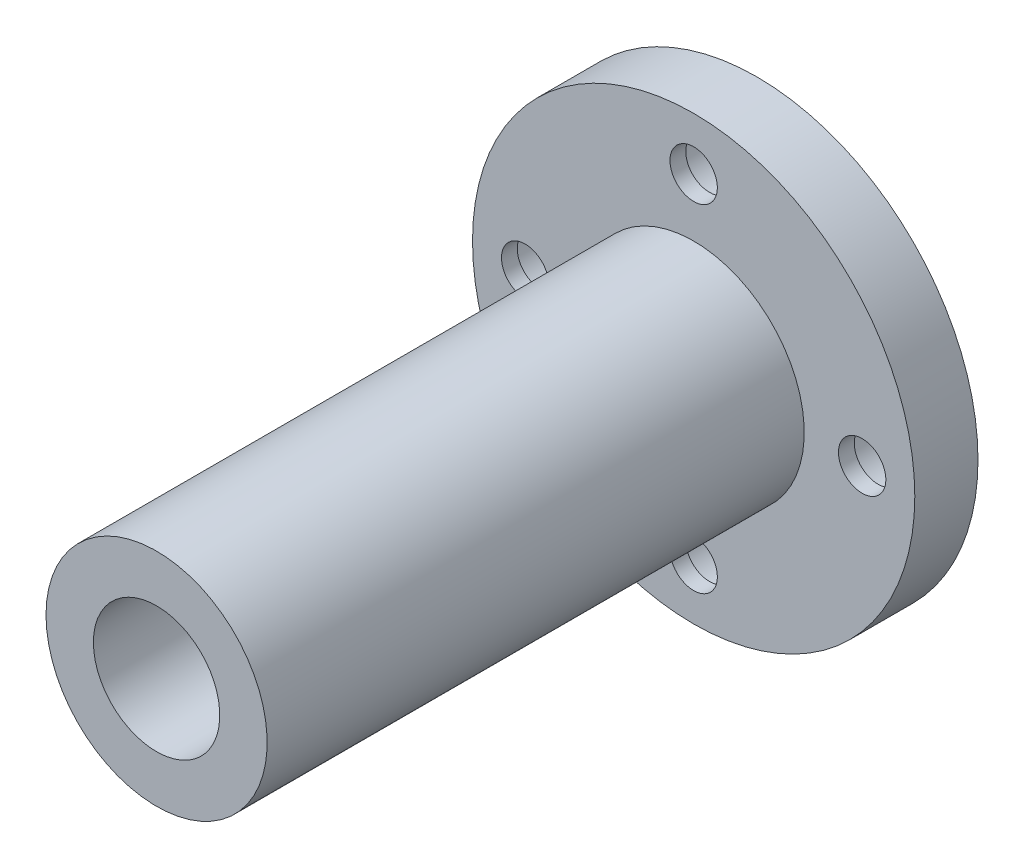
ISO-10303-21;
HEADER;
FILE_DESCRIPTION(('STEP AP214'),'2;1');
FILE_NAME('part.step','',(''),(''),'','','');
FILE_SCHEMA(('AUTOMOTIVE_DESIGN { 1 0 10303 214 1 1 1 1 }'));
ENDSEC;
DATA;
#1=APPLICATION_CONTEXT('core data for automotive mechanical design processes');
#2=APPLICATION_PROTOCOL_DEFINITION('international standard','automotive_design',2000,#1);
#3=PRODUCT_CONTEXT('',#1,'mechanical');
#4=PRODUCT('Part','Part','',(#3));
#5=PRODUCT_RELATED_PRODUCT_CATEGORY('part','',(#4));
#6=PRODUCT_DEFINITION_FORMATION('','',#4);
#7=PRODUCT_DEFINITION_CONTEXT('part definition',#1,'design');
#8=PRODUCT_DEFINITION('design','',#6,#7);
#9=PRODUCT_DEFINITION_SHAPE('','',#8);
#10=(LENGTH_UNIT() NAMED_UNIT(*) SI_UNIT(.MILLI.,.METRE.));
#11=(NAMED_UNIT(*) PLANE_ANGLE_UNIT() SI_UNIT($,.RADIAN.));
#12=(NAMED_UNIT(*) SI_UNIT($,.STERADIAN.) SOLID_ANGLE_UNIT());
#13=UNCERTAINTY_MEASURE_WITH_UNIT(LENGTH_MEASURE(1.E-05),#10,'distance_accuracy_value','');
#14=(GEOMETRIC_REPRESENTATION_CONTEXT(3) GLOBAL_UNCERTAINTY_ASSIGNED_CONTEXT((#13)) GLOBAL_UNIT_ASSIGNED_CONTEXT((#10,
#11,#12)) REPRESENTATION_CONTEXT('',''));
#15=CARTESIAN_POINT('',(0.,0.,0.));
#16=DIRECTION('',(0.,0.,1.));
#17=DIRECTION('',(1.,0.,0.));
#18=AXIS2_PLACEMENT_3D('',#15,#16,#17);
#19=CARTESIAN_POINT('',(16.,0.,0.));
#20=DIRECTION('',(0.,0.,1.));
#21=DIRECTION('',(1.,0.,0.));
#22=AXIS2_PLACEMENT_3D('',#19,#20,#21);
#23=CYLINDRICAL_SURFACE('',#22,2.25);
#24=CARTESIAN_POINT('',(16.,0.,6.));
#25=DIRECTION('',(0.,0.,1.));
#26=DIRECTION('',(1.,0.,0.));
#27=AXIS2_PLACEMENT_3D('',#24,#25,#26);
#28=CIRCLE('',#27,2.25);
#29=CARTESIAN_POINT('',(18.25,0.,6.));
#30=VERTEX_POINT('',#29);
#31=EDGE_CURVE('E86',#30,#30,#28,.T.);
#32=ORIENTED_EDGE('',*,*,#31,.T.);
#33=EDGE_LOOP('',(#32));
#34=FACE_BOUND('',#33,.T.);
#35=CARTESIAN_POINT('',(16.,0.,4.5));
#36=DIRECTION('',(0.,0.,-1.));
#37=DIRECTION('',(-1.,0.,0.));
#38=AXIS2_PLACEMENT_3D('',#35,#36,#37);
#39=CIRCLE('',#38,2.25);
#40=CARTESIAN_POINT('',(13.75,0.,4.5));
#41=VERTEX_POINT('',#40);
#42=EDGE_CURVE('E34',#41,#41,#39,.F.);
#43=ORIENTED_EDGE('',*,*,#42,.F.);
#44=EDGE_LOOP('',(#43));
#45=FACE_BOUND('',#44,.T.);
#46=ADVANCED_FACE('F30',(#34,#45),#23,.F.);
#47=CARTESIAN_POINT('',(0.,-16.,0.));
#48=DIRECTION('',(0.,0.,1.));
#49=DIRECTION('',(1.,0.,0.));
#50=AXIS2_PLACEMENT_3D('',#47,#48,#49);
#51=CYLINDRICAL_SURFACE('',#50,2.25);
#52=CARTESIAN_POINT('',(0.,-16.,6.));
#53=DIRECTION('',(0.,0.,1.));
#54=DIRECTION('',(1.,0.,0.));
#55=AXIS2_PLACEMENT_3D('',#52,#53,#54);
#56=CIRCLE('',#55,2.25);
#57=CARTESIAN_POINT('',(2.25,-16.,6.));
#58=VERTEX_POINT('',#57);
#59=EDGE_CURVE('E83',#58,#58,#56,.T.);
#60=ORIENTED_EDGE('',*,*,#59,.T.);
#61=EDGE_LOOP('',(#60));
#62=FACE_BOUND('',#61,.T.);
#63=CARTESIAN_POINT('',(0.,-16.,4.5));
#64=DIRECTION('',(0.,0.,-1.));
#65=DIRECTION('',(-1.,0.,0.));
#66=AXIS2_PLACEMENT_3D('',#63,#64,#65);
#67=CIRCLE('',#66,2.25);
#68=CARTESIAN_POINT('',(-2.25,-16.,4.5));
#69=VERTEX_POINT('',#68);
#70=EDGE_CURVE('E56',#69,#69,#67,.F.);
#71=ORIENTED_EDGE('',*,*,#70,.F.);
#72=EDGE_LOOP('',(#71));
#73=FACE_BOUND('',#72,.T.);
#74=ADVANCED_FACE('F118',(#62,#73),#51,.F.);
#75=CARTESIAN_POINT('',(-16.,0.,0.));
#76=DIRECTION('',(0.,0.,1.));
#77=DIRECTION('',(1.,0.,0.));
#78=AXIS2_PLACEMENT_3D('',#75,#76,#77);
#79=CYLINDRICAL_SURFACE('',#78,2.25);
#80=CARTESIAN_POINT('',(-16.,0.,6.));
#81=DIRECTION('',(0.,0.,1.));
#82=DIRECTION('',(1.,0.,0.));
#83=AXIS2_PLACEMENT_3D('',#80,#81,#82);
#84=CIRCLE('',#83,2.25);
#85=CARTESIAN_POINT('',(-13.75,0.,6.));
#86=VERTEX_POINT('',#85);
#87=EDGE_CURVE('E50',#86,#86,#84,.T.);
#88=ORIENTED_EDGE('',*,*,#87,.T.);
#89=EDGE_LOOP('',(#88));
#90=FACE_BOUND('',#89,.T.);
#91=CARTESIAN_POINT('',(-16.,0.,4.5));
#92=DIRECTION('',(0.,0.,-1.));
#93=DIRECTION('',(-1.,0.,0.));
#94=AXIS2_PLACEMENT_3D('',#91,#92,#93);
#95=CIRCLE('',#94,2.25);
#96=CARTESIAN_POINT('',(-18.25,0.,4.5));
#97=VERTEX_POINT('',#96);
#98=EDGE_CURVE('E52',#97,#97,#95,.F.);
#99=ORIENTED_EDGE('',*,*,#98,.F.);
#100=EDGE_LOOP('',(#99));
#101=FACE_BOUND('',#100,.T.);
#102=ADVANCED_FACE('F124',(#90,#101),#79,.F.);
#103=CARTESIAN_POINT('',(0.,16.,0.));
#104=DIRECTION('',(0.,0.,1.));
#105=DIRECTION('',(1.,0.,0.));
#106=AXIS2_PLACEMENT_3D('',#103,#104,#105);
#107=CYLINDRICAL_SURFACE('',#106,2.25);
#108=CARTESIAN_POINT('',(0.,16.,6.));
#109=DIRECTION('',(0.,0.,1.));
#110=DIRECTION('',(1.,0.,0.));
#111=AXIS2_PLACEMENT_3D('',#108,#109,#110);
#112=CIRCLE('',#111,2.25);
#113=CARTESIAN_POINT('',(2.25,16.,6.));
#114=VERTEX_POINT('',#113);
#115=EDGE_CURVE('E89',#114,#114,#112,.T.);
#116=ORIENTED_EDGE('',*,*,#115,.T.);
#117=EDGE_LOOP('',(#116));
#118=FACE_BOUND('',#117,.T.);
#119=CARTESIAN_POINT('',(0.,16.,4.5));
#120=DIRECTION('',(0.,0.,-1.));
#121=DIRECTION('',(-1.,0.,0.));
#122=AXIS2_PLACEMENT_3D('',#119,#120,#121);
#123=CIRCLE('',#122,2.25);
#124=CARTESIAN_POINT('',(-2.25,16.,4.5));
#125=VERTEX_POINT('',#124);
#126=EDGE_CURVE('E47',#125,#125,#123,.F.);
#127=ORIENTED_EDGE('',*,*,#126,.F.);
#128=EDGE_LOOP('',(#127));
#129=FACE_BOUND('',#128,.T.);
#130=ADVANCED_FACE('F130',(#118,#129),#107,.F.);
#131=CARTESIAN_POINT('',(0.,21.,0.));
#132=DIRECTION('',(0.,0.,-1.));
#133=DIRECTION('',(-1.,0.,0.));
#134=AXIS2_PLACEMENT_3D('',#131,#132,#133);
#135=PLANE('',#134);
#136=CARTESIAN_POINT('',(16.,0.,0.));
#137=DIRECTION('',(0.,0.,-1.));
#138=DIRECTION('',(-1.,0.,0.));
#139=AXIS2_PLACEMENT_3D('',#136,#137,#138);
#140=CIRCLE('',#139,3.75);
#141=CARTESIAN_POINT('',(12.25,0.,0.));
#142=VERTEX_POINT('',#141);
#143=EDGE_CURVE('E72',#142,#142,#140,.T.);
#144=ORIENTED_EDGE('',*,*,#143,.F.);
#145=EDGE_LOOP('',(#144));
#146=FACE_BOUND('',#145,.T.);
#147=CARTESIAN_POINT('',(0.,-16.,0.));
#148=DIRECTION('',(0.,0.,-1.));
#149=DIRECTION('',(-1.,0.,0.));
#150=AXIS2_PLACEMENT_3D('',#147,#148,#149);
#151=CIRCLE('',#150,3.75);
#152=CARTESIAN_POINT('',(-3.75,-16.,0.));
#153=VERTEX_POINT('',#152);
#154=EDGE_CURVE('E65',#153,#153,#151,.T.);
#155=ORIENTED_EDGE('',*,*,#154,.F.);
#156=EDGE_LOOP('',(#155));
#157=FACE_BOUND('',#156,.T.);
#158=CARTESIAN_POINT('',(-16.,0.,0.));
#159=DIRECTION('',(0.,0.,-1.));
#160=DIRECTION('',(-1.,0.,0.));
#161=AXIS2_PLACEMENT_3D('',#158,#159,#160);
#162=CIRCLE('',#161,3.75);
#163=CARTESIAN_POINT('',(-19.75,0.,0.));
#164=VERTEX_POINT('',#163);
#165=EDGE_CURVE('E58',#164,#164,#162,.T.);
#166=ORIENTED_EDGE('',*,*,#165,.F.);
#167=EDGE_LOOP('',(#166));
#168=FACE_BOUND('',#167,.T.);
#169=CARTESIAN_POINT('',(0.,16.,0.));
#170=DIRECTION('',(0.,0.,-1.));
#171=DIRECTION('',(-1.,0.,0.));
#172=AXIS2_PLACEMENT_3D('',#169,#170,#171);
#173=CIRCLE('',#172,3.75);
#174=CARTESIAN_POINT('',(-3.75,16.,0.));
#175=VERTEX_POINT('',#174);
#176=EDGE_CURVE('E54',#175,#175,#173,.T.);
#177=ORIENTED_EDGE('',*,*,#176,.F.);
#178=EDGE_LOOP('',(#177));
#179=FACE_BOUND('',#178,.T.);
#180=CARTESIAN_POINT('',(0.,0.,0.));
#181=DIRECTION('',(0.,0.,-1.));
#182=DIRECTION('',(-1.,0.,0.));
#183=AXIS2_PLACEMENT_3D('',#180,#181,#182);
#184=CIRCLE('',#183,21.);
#185=CARTESIAN_POINT('',(-21.,0.,0.));
#186=VERTEX_POINT('',#185);
#187=EDGE_CURVE('E92',#186,#186,#184,.T.);
#188=ORIENTED_EDGE('',*,*,#187,.T.);
#189=EDGE_LOOP('',(#188));
#190=FACE_BOUND('',#189,.T.);
#191=CARTESIAN_POINT('',(0.,0.,0.));
#192=DIRECTION('',(0.,0.,-1.));
#193=DIRECTION('',(-1.,0.,0.));
#194=AXIS2_PLACEMENT_3D('',#191,#192,#193);
#195=CIRCLE('',#194,6.);
#196=CARTESIAN_POINT('',(-6.,0.,0.));
#197=VERTEX_POINT('',#196);
#198=EDGE_CURVE('E10',#197,#197,#195,.T.);
#199=ORIENTED_EDGE('',*,*,#198,.F.);
#200=EDGE_LOOP('',(#199));
#201=FACE_BOUND('',#200,.T.);
#202=ADVANCED_FACE('F32',(#146,#157,#168,#179,#190,#201),#135,.T.);
#203=CARTESIAN_POINT('',(0.,0.,0.));
#204=DIRECTION('',(0.,0.,-1.));
#205=DIRECTION('',(-1.,0.,0.));
#206=AXIS2_PLACEMENT_3D('',#203,#204,#205);
#207=CYLINDRICAL_SURFACE('',#206,6.);
#208=ORIENTED_EDGE('',*,*,#198,.T.);
#209=EDGE_LOOP('',(#208));
#210=FACE_BOUND('',#209,.T.);
#211=CARTESIAN_POINT('',(0.,0.,57.));
#212=DIRECTION('',(0.,0.,-1.));
#213=DIRECTION('',(-1.,0.,0.));
#214=AXIS2_PLACEMENT_3D('',#211,#212,#213);
#215=CIRCLE('',#214,5.99999999999999);
#216=CARTESIAN_POINT('',(-5.99999999999999,0.,57.));
#217=VERTEX_POINT('',#216);
#218=EDGE_CURVE('E38',#217,#217,#215,.T.);
#219=ORIENTED_EDGE('',*,*,#218,.F.);
#220=EDGE_LOOP('',(#219));
#221=FACE_BOUND('',#220,.T.);
#222=ADVANCED_FACE('F108',(#210,#221),#207,.F.);
#223=CARTESIAN_POINT('',(0.,5.99999999999999,57.));
#224=DIRECTION('',(0.,0.,1.));
#225=DIRECTION('',(1.,0.,0.));
#226=AXIS2_PLACEMENT_3D('',#223,#224,#225);
#227=PLANE('',#226);
#228=ORIENTED_EDGE('',*,*,#218,.T.);
#229=EDGE_LOOP('',(#228));
#230=FACE_BOUND('',#229,.T.);
#231=CARTESIAN_POINT('',(0.,0.,57.));
#232=DIRECTION('',(0.,0.,-1.));
#233=DIRECTION('',(-1.,0.,0.));
#234=AXIS2_PLACEMENT_3D('',#231,#232,#233);
#235=CIRCLE('',#234,10.5);
#236=CARTESIAN_POINT('',(-10.5,0.,57.));
#237=VERTEX_POINT('',#236);
#238=EDGE_CURVE('E43',#237,#237,#235,.T.);
#239=ORIENTED_EDGE('',*,*,#238,.F.);
#240=EDGE_LOOP('',(#239));
#241=FACE_BOUND('',#240,.T.);
#242=ADVANCED_FACE('F106',(#230,#241),#227,.T.);
#243=CARTESIAN_POINT('',(0.,0.,0.));
#244=DIRECTION('',(0.,0.,-1.));
#245=DIRECTION('',(-1.,0.,0.));
#246=AXIS2_PLACEMENT_3D('',#243,#244,#245);
#247=CYLINDRICAL_SURFACE('',#246,10.5);
#248=ORIENTED_EDGE('',*,*,#238,.T.);
#249=EDGE_LOOP('',(#248));
#250=FACE_BOUND('',#249,.T.);
#251=CARTESIAN_POINT('',(0.,0.,6.));
#252=DIRECTION('',(0.,0.,-1.));
#253=DIRECTION('',(-1.,0.,0.));
#254=AXIS2_PLACEMENT_3D('',#251,#252,#253);
#255=CIRCLE('',#254,10.5);
#256=CARTESIAN_POINT('',(-10.5,0.,6.));
#257=VERTEX_POINT('',#256);
#258=EDGE_CURVE('E98',#257,#257,#255,.T.);
#259=ORIENTED_EDGE('',*,*,#258,.F.);
#260=EDGE_LOOP('',(#259));
#261=FACE_BOUND('',#260,.T.);
#262=ADVANCED_FACE('F103',(#250,#261),#247,.T.);
#263=CARTESIAN_POINT('',(0.,10.5,6.));
#264=DIRECTION('',(0.,0.,1.));
#265=DIRECTION('',(1.,0.,0.));
#266=AXIS2_PLACEMENT_3D('',#263,#264,#265);
#267=PLANE('',#266);
#268=ORIENTED_EDGE('',*,*,#87,.F.);
#269=EDGE_LOOP('',(#268));
#270=FACE_BOUND('',#269,.T.);
#271=ORIENTED_EDGE('',*,*,#59,.F.);
#272=EDGE_LOOP('',(#271));
#273=FACE_BOUND('',#272,.T.);
#274=ORIENTED_EDGE('',*,*,#31,.F.);
#275=EDGE_LOOP('',(#274));
#276=FACE_BOUND('',#275,.T.);
#277=ORIENTED_EDGE('',*,*,#115,.F.);
#278=EDGE_LOOP('',(#277));
#279=FACE_BOUND('',#278,.T.);
#280=ORIENTED_EDGE('',*,*,#258,.T.);
#281=EDGE_LOOP('',(#280));
#282=FACE_BOUND('',#281,.T.);
#283=CARTESIAN_POINT('',(0.,0.,6.));
#284=DIRECTION('',(0.,0.,-1.));
#285=DIRECTION('',(-1.,0.,0.));
#286=AXIS2_PLACEMENT_3D('',#283,#284,#285);
#287=CIRCLE('',#286,21.);
#288=CARTESIAN_POINT('',(-21.,0.,6.));
#289=VERTEX_POINT('',#288);
#290=EDGE_CURVE('E95',#289,#289,#287,.T.);
#291=ORIENTED_EDGE('',*,*,#290,.F.);
#292=EDGE_LOOP('',(#291));
#293=FACE_BOUND('',#292,.T.);
#294=ADVANCED_FACE('F115',(#270,#273,#276,#279,#282,#293),#267,.T.);
#295=CARTESIAN_POINT('',(0.,0.,0.));
#296=DIRECTION('',(0.,0.,-1.));
#297=DIRECTION('',(-1.,0.,0.));
#298=AXIS2_PLACEMENT_3D('',#295,#296,#297);
#299=CYLINDRICAL_SURFACE('',#298,21.);
#300=ORIENTED_EDGE('',*,*,#290,.T.);
#301=EDGE_LOOP('',(#300));
#302=FACE_BOUND('',#301,.T.);
#303=ORIENTED_EDGE('',*,*,#187,.F.);
#304=EDGE_LOOP('',(#303));
#305=FACE_BOUND('',#304,.T.);
#306=ADVANCED_FACE('F134',(#302,#305),#299,.T.);
#307=CARTESIAN_POINT('',(0.,16.,4.5));
#308=DIRECTION('',(0.,0.,-1.));
#309=DIRECTION('',(-1.,0.,0.));
#310=AXIS2_PLACEMENT_3D('',#307,#308,#309);
#311=PLANE('',#310);
#312=CARTESIAN_POINT('',(0.,16.,4.5));
#313=DIRECTION('',(0.,0.,-1.));
#314=DIRECTION('',(-1.,0.,0.));
#315=AXIS2_PLACEMENT_3D('',#312,#313,#314);
#316=CIRCLE('',#315,3.75);
#317=CARTESIAN_POINT('',(-3.75,16.,4.5));
#318=VERTEX_POINT('',#317);
#319=EDGE_CURVE('E51',#318,#318,#316,.T.);
#320=ORIENTED_EDGE('',*,*,#319,.T.);
#321=EDGE_LOOP('',(#320));
#322=FACE_BOUND('',#321,.T.);
#323=ORIENTED_EDGE('',*,*,#126,.T.);
#324=EDGE_LOOP('',(#323));
#325=FACE_BOUND('',#324,.T.);
#326=ADVANCED_FACE('F137',(#322,#325),#311,.T.);
#327=CARTESIAN_POINT('',(0.,16.,4.5));
#328=DIRECTION('',(0.,0.,-1.));
#329=DIRECTION('',(-1.,0.,0.));
#330=AXIS2_PLACEMENT_3D('',#327,#328,#329);
#331=CYLINDRICAL_SURFACE('',#330,3.75);
#332=ORIENTED_EDGE('',*,*,#319,.F.);
#333=EDGE_LOOP('',(#332));
#334=FACE_BOUND('',#333,.T.);
#335=ORIENTED_EDGE('',*,*,#176,.T.);
#336=EDGE_LOOP('',(#335));
#337=FACE_BOUND('',#336,.T.);
#338=ADVANCED_FACE('F171',(#334,#337),#331,.F.);
#339=CARTESIAN_POINT('',(-16.,0.,4.5));
#340=DIRECTION('',(0.,0.,-1.));
#341=DIRECTION('',(-1.,0.,0.));
#342=AXIS2_PLACEMENT_3D('',#339,#340,#341);
#343=PLANE('',#342);
#344=CARTESIAN_POINT('',(-16.,0.,4.5));
#345=DIRECTION('',(0.,0.,-1.));
#346=DIRECTION('',(-1.,0.,0.));
#347=AXIS2_PLACEMENT_3D('',#344,#345,#346);
#348=CIRCLE('',#347,3.75);
#349=CARTESIAN_POINT('',(-19.75,0.,4.5));
#350=VERTEX_POINT('',#349);
#351=EDGE_CURVE('E55',#350,#350,#348,.T.);
#352=ORIENTED_EDGE('',*,*,#351,.T.);
#353=EDGE_LOOP('',(#352));
#354=FACE_BOUND('',#353,.T.);
#355=ORIENTED_EDGE('',*,*,#98,.T.);
#356=EDGE_LOOP('',(#355));
#357=FACE_BOUND('',#356,.T.);
#358=ADVANCED_FACE('F173',(#354,#357),#343,.T.);
#359=CARTESIAN_POINT('',(-16.,0.,4.5));
#360=DIRECTION('',(0.,0.,-1.));
#361=DIRECTION('',(-1.,0.,0.));
#362=AXIS2_PLACEMENT_3D('',#359,#360,#361);
#363=CYLINDRICAL_SURFACE('',#362,3.75);
#364=ORIENTED_EDGE('',*,*,#351,.F.);
#365=EDGE_LOOP('',(#364));
#366=FACE_BOUND('',#365,.T.);
#367=ORIENTED_EDGE('',*,*,#165,.T.);
#368=EDGE_LOOP('',(#367));
#369=FACE_BOUND('',#368,.T.);
#370=ADVANCED_FACE('F180',(#366,#369),#363,.F.);
#371=CARTESIAN_POINT('',(0.,-16.,4.5));
#372=DIRECTION('',(0.,0.,-1.));
#373=DIRECTION('',(-1.,0.,0.));
#374=AXIS2_PLACEMENT_3D('',#371,#372,#373);
#375=PLANE('',#374);
#376=CARTESIAN_POINT('',(0.,-16.,4.5));
#377=DIRECTION('',(0.,0.,-1.));
#378=DIRECTION('',(-1.,0.,0.));
#379=AXIS2_PLACEMENT_3D('',#376,#377,#378);
#380=CIRCLE('',#379,3.75);
#381=CARTESIAN_POINT('',(-3.75,-16.,4.5));
#382=VERTEX_POINT('',#381);
#383=EDGE_CURVE('E59',#382,#382,#380,.T.);
#384=ORIENTED_EDGE('',*,*,#383,.T.);
#385=EDGE_LOOP('',(#384));
#386=FACE_BOUND('',#385,.T.);
#387=ORIENTED_EDGE('',*,*,#70,.T.);
#388=EDGE_LOOP('',(#387));
#389=FACE_BOUND('',#388,.T.);
#390=ADVANCED_FACE('F232',(#386,#389),#375,.T.);
#391=CARTESIAN_POINT('',(0.,-16.,4.5));
#392=DIRECTION('',(0.,0.,-1.));
#393=DIRECTION('',(-1.,0.,0.));
#394=AXIS2_PLACEMENT_3D('',#391,#392,#393);
#395=CYLINDRICAL_SURFACE('',#394,3.75);
#396=ORIENTED_EDGE('',*,*,#383,.F.);
#397=EDGE_LOOP('',(#396));
#398=FACE_BOUND('',#397,.T.);
#399=ORIENTED_EDGE('',*,*,#154,.T.);
#400=EDGE_LOOP('',(#399));
#401=FACE_BOUND('',#400,.T.);
#402=ADVANCED_FACE('F241',(#398,#401),#395,.F.);
#403=CARTESIAN_POINT('',(16.,0.,4.5));
#404=DIRECTION('',(0.,0.,-1.));
#405=DIRECTION('',(-1.,0.,0.));
#406=AXIS2_PLACEMENT_3D('',#403,#404,#405);
#407=PLANE('',#406);
#408=CARTESIAN_POINT('',(16.,0.,4.5));
#409=DIRECTION('',(0.,0.,-1.));
#410=DIRECTION('',(-1.,0.,0.));
#411=AXIS2_PLACEMENT_3D('',#408,#409,#410);
#412=CIRCLE('',#411,3.75);
#413=CARTESIAN_POINT('',(12.25,0.,4.5));
#414=VERTEX_POINT('',#413);
#415=EDGE_CURVE('E277',#414,#414,#412,.T.);
#416=ORIENTED_EDGE('',*,*,#415,.T.);
#417=EDGE_LOOP('',(#416));
#418=FACE_BOUND('',#417,.T.);
#419=ORIENTED_EDGE('',*,*,#42,.T.);
#420=EDGE_LOOP('',(#419));
#421=FACE_BOUND('',#420,.T.);
#422=ADVANCED_FACE('F250',(#418,#421),#407,.T.);
#423=CARTESIAN_POINT('',(16.,0.,4.5));
#424=DIRECTION('',(0.,0.,-1.));
#425=DIRECTION('',(-1.,0.,0.));
#426=AXIS2_PLACEMENT_3D('',#423,#424,#425);
#427=CYLINDRICAL_SURFACE('',#426,3.75);
#428=ORIENTED_EDGE('',*,*,#415,.F.);
#429=EDGE_LOOP('',(#428));
#430=FACE_BOUND('',#429,.T.);
#431=ORIENTED_EDGE('',*,*,#143,.T.);
#432=EDGE_LOOP('',(#431));
#433=FACE_BOUND('',#432,.T.);
#434=ADVANCED_FACE('F260',(#430,#433),#427,.F.);
#435=CLOSED_SHELL('',(#46,#74,#102,#130,#202,#222,#242,#262,#294,#306,#326,#338,#358,#370,#390,
#402,#422,#434));
#436=MANIFOLD_SOLID_BREP('B2',#435);
#437=ADVANCED_BREP_SHAPE_REPRESENTATION('',(#18,#436),#14);
#438=SHAPE_DEFINITION_REPRESENTATION(#9,#437);
ENDSEC;
END-ISO-10303-21;
